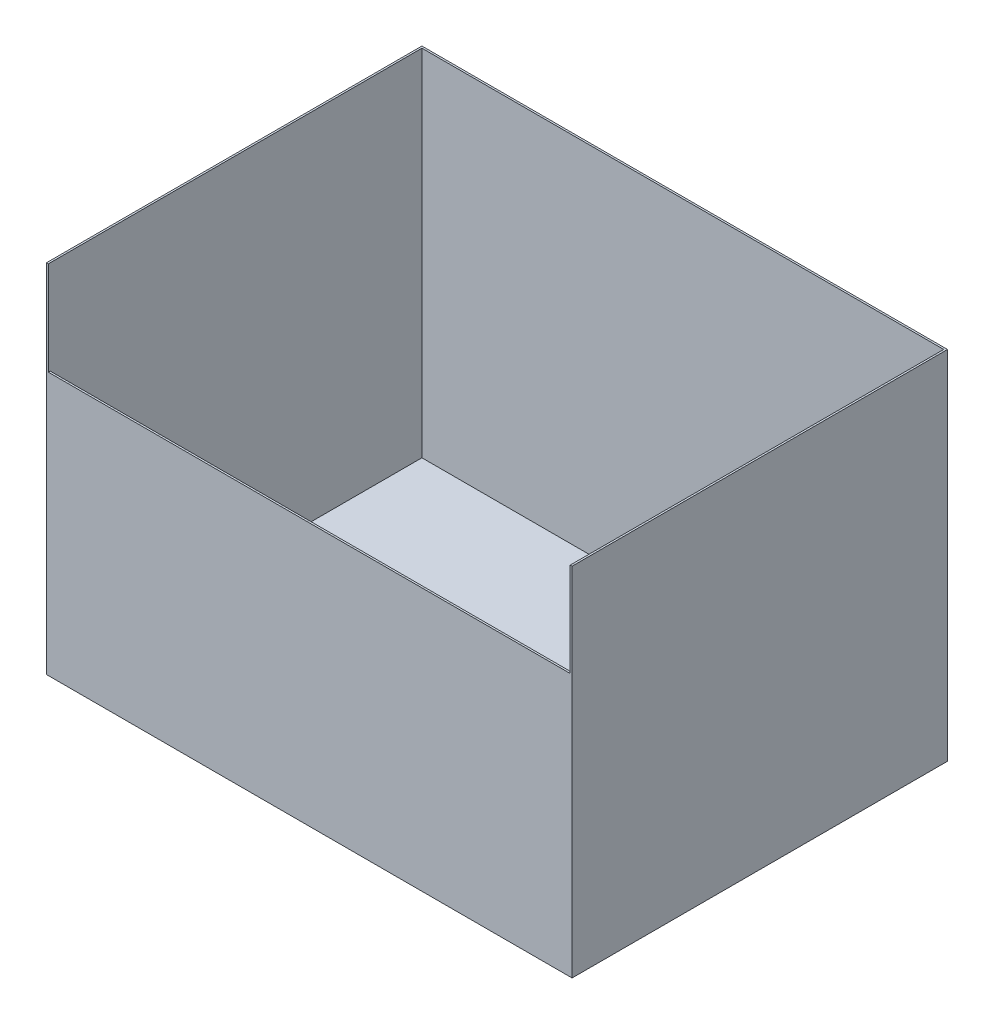
ISO-10303-21;
HEADER;
FILE_DESCRIPTION(('STEP AP214'),'2;1');
FILE_NAME('part.step','',(''),(''),'','','');
FILE_SCHEMA(('AUTOMOTIVE_DESIGN { 1 0 10303 214 1 1 1 1 }'));
ENDSEC;
DATA;
#1=APPLICATION_CONTEXT('core data for automotive mechanical design processes');
#2=APPLICATION_PROTOCOL_DEFINITION('international standard','automotive_design',2000,#1);
#3=PRODUCT_CONTEXT('',#1,'mechanical');
#4=PRODUCT('Part','Part','',(#3));
#5=PRODUCT_RELATED_PRODUCT_CATEGORY('part','',(#4));
#6=PRODUCT_DEFINITION_FORMATION('','',#4);
#7=PRODUCT_DEFINITION_CONTEXT('part definition',#1,'design');
#8=PRODUCT_DEFINITION('design','',#6,#7);
#9=PRODUCT_DEFINITION_SHAPE('','',#8);
#10=(LENGTH_UNIT() NAMED_UNIT(*) SI_UNIT(.MILLI.,.METRE.));
#11=(NAMED_UNIT(*) PLANE_ANGLE_UNIT() SI_UNIT($,.RADIAN.));
#12=(NAMED_UNIT(*) SI_UNIT($,.STERADIAN.) SOLID_ANGLE_UNIT());
#13=UNCERTAINTY_MEASURE_WITH_UNIT(LENGTH_MEASURE(1.E-05),#10,'distance_accuracy_value','');
#14=(GEOMETRIC_REPRESENTATION_CONTEXT(3) GLOBAL_UNCERTAINTY_ASSIGNED_CONTEXT((#13)) GLOBAL_UNIT_ASSIGNED_CONTEXT((#10,
#11,#12)) REPRESENTATION_CONTEXT('',''));
#15=CARTESIAN_POINT('',(0.,0.,0.));
#16=DIRECTION('',(0.,0.,1.));
#17=DIRECTION('',(1.,0.,0.));
#18=AXIS2_PLACEMENT_3D('',#15,#16,#17);
#19=CARTESIAN_POINT('',(-355.6,241.3,-254.));
#20=DIRECTION('',(1.,0.,0.));
#21=DIRECTION('',(0.,0.,-1.));
#22=AXIS2_PLACEMENT_3D('',#19,#20,#21);
#23=PLANE('',#22);
#24=DIRECTION('',(0.,0.,1.));
#25=VECTOR('',#24,1.);
#26=CARTESIAN_POINT('',(-355.6,-241.3,-254.));
#27=LINE('',#26,#25);
#28=CARTESIAN_POINT('',(-355.6,-241.3,-254.));
#29=VERTEX_POINT('',#28);
#30=CARTESIAN_POINT('',(-355.6,-241.3,254.));
#31=VERTEX_POINT('',#30);
#32=EDGE_CURVE('E145',#29,#31,#27,.T.);
#33=ORIENTED_EDGE('',*,*,#32,.T.);
#34=DIRECTION('',(0.,-1.,0.));
#35=VECTOR('',#34,1.);
#36=CARTESIAN_POINT('',(-355.6,241.3,254.));
#37=LINE('',#36,#35);
#38=CARTESIAN_POINT('',(-355.6,241.3,254.));
#39=VERTEX_POINT('',#38);
#40=EDGE_CURVE('E11',#39,#31,#37,.T.);
#41=ORIENTED_EDGE('',*,*,#40,.F.);
#42=DIRECTION('',(0.,0.,1.));
#43=VECTOR('',#42,1.);
#44=CARTESIAN_POINT('',(-355.6,241.3,-254.));
#45=LINE('',#44,#43);
#46=CARTESIAN_POINT('',(-355.6,241.3,-254.));
#47=VERTEX_POINT('',#46);
#48=EDGE_CURVE('E162',#47,#39,#45,.T.);
#49=ORIENTED_EDGE('',*,*,#48,.F.);
#50=DIRECTION('',(0.,-1.,0.));
#51=VECTOR('',#50,1.);
#52=CARTESIAN_POINT('',(-355.6,241.3,-254.));
#53=LINE('',#52,#51);
#54=EDGE_CURVE('E169',#47,#29,#53,.T.);
#55=ORIENTED_EDGE('',*,*,#54,.T.);
#56=EDGE_LOOP('',(#33,#41,#49,#55));
#57=FACE_BOUND('',#56,.T.);
#58=ADVANCED_FACE('F33',(#57),#23,.F.);
#59=CARTESIAN_POINT('',(-355.6,241.3,254.));
#60=DIRECTION('',(0.,0.,-1.));
#61=DIRECTION('',(-1.,0.,0.));
#62=AXIS2_PLACEMENT_3D('',#59,#60,#61);
#63=PLANE('',#62);
#64=DIRECTION('',(1.,0.,0.));
#65=VECTOR('',#64,1.);
#66=CARTESIAN_POINT('',(-353.06,114.3,254.));
#67=LINE('',#66,#65);
#68=CARTESIAN_POINT('',(-353.06,114.3,254.));
#69=VERTEX_POINT('',#68);
#70=CARTESIAN_POINT('',(353.06,114.3,254.));
#71=VERTEX_POINT('',#70);
#72=EDGE_CURVE('E125',#69,#71,#67,.T.);
#73=ORIENTED_EDGE('',*,*,#72,.F.);
#74=DIRECTION('',(0.,-1.,0.));
#75=VECTOR('',#74,1.);
#76=CARTESIAN_POINT('',(-353.06,241.3,254.));
#77=LINE('',#76,#75);
#78=CARTESIAN_POINT('',(-353.06,241.3,254.));
#79=VERTEX_POINT('',#78);
#80=EDGE_CURVE('E130',#79,#69,#77,.T.);
#81=ORIENTED_EDGE('',*,*,#80,.F.);
#82=DIRECTION('',(1.,0.,0.));
#83=VECTOR('',#82,1.);
#84=CARTESIAN_POINT('',(-355.6,241.3,254.));
#85=LINE('',#84,#83);
#86=EDGE_CURVE('E84',#39,#79,#85,.T.);
#87=ORIENTED_EDGE('',*,*,#86,.F.);
#88=ORIENTED_EDGE('',*,*,#40,.T.);
#89=DIRECTION('',(1.,0.,0.));
#90=VECTOR('',#89,1.);
#91=CARTESIAN_POINT('',(-355.6,-241.3,254.));
#92=LINE('',#91,#90);
#93=CARTESIAN_POINT('',(355.6,-241.3,254.));
#94=VERTEX_POINT('',#93);
#95=EDGE_CURVE('E172',#31,#94,#92,.T.);
#96=ORIENTED_EDGE('',*,*,#95,.T.);
#97=DIRECTION('',(0.,-1.,0.));
#98=VECTOR('',#97,1.);
#99=CARTESIAN_POINT('',(355.6,241.3,254.));
#100=LINE('',#99,#98);
#101=CARTESIAN_POINT('',(355.6,241.3,254.));
#102=VERTEX_POINT('',#101);
#103=EDGE_CURVE('E40',#102,#94,#100,.T.);
#104=ORIENTED_EDGE('',*,*,#103,.F.);
#105=CARTESIAN_POINT('',(353.06,241.3,254.));
#106=VERTEX_POINT('',#105);
#107=EDGE_CURVE('E164',#106,#102,#85,.T.);
#108=ORIENTED_EDGE('',*,*,#107,.F.);
#109=DIRECTION('',(0.,1.,0.));
#110=VECTOR('',#109,1.);
#111=CARTESIAN_POINT('',(353.06,241.3,254.));
#112=LINE('',#111,#110);
#113=EDGE_CURVE('E212',#71,#106,#112,.T.);
#114=ORIENTED_EDGE('',*,*,#113,.F.);
#115=EDGE_LOOP('',(#73,#81,#87,#88,#96,#104,#108,#114));
#116=FACE_BOUND('',#115,.T.);
#117=ADVANCED_FACE('F202',(#116),#63,.F.);
#118=CARTESIAN_POINT('',(355.6,241.3,-254.));
#119=DIRECTION('',(-1.,0.,0.));
#120=DIRECTION('',(0.,0.,1.));
#121=AXIS2_PLACEMENT_3D('',#118,#119,#120);
#122=PLANE('',#121);
#123=DIRECTION('',(0.,0.,-1.));
#124=VECTOR('',#123,1.);
#125=CARTESIAN_POINT('',(355.6,-241.3,-254.));
#126=LINE('',#125,#124);
#127=CARTESIAN_POINT('',(355.6,-241.3,-254.));
#128=VERTEX_POINT('',#127);
#129=EDGE_CURVE('E174',#94,#128,#126,.T.);
#130=ORIENTED_EDGE('',*,*,#129,.T.);
#131=DIRECTION('',(0.,-1.,0.));
#132=VECTOR('',#131,1.);
#133=CARTESIAN_POINT('',(355.6,241.3,-254.));
#134=LINE('',#133,#132);
#135=CARTESIAN_POINT('',(355.6,241.3,-254.));
#136=VERTEX_POINT('',#135);
#137=EDGE_CURVE('E178',#136,#128,#134,.T.);
#138=ORIENTED_EDGE('',*,*,#137,.F.);
#139=DIRECTION('',(0.,0.,-1.));
#140=VECTOR('',#139,1.);
#141=CARTESIAN_POINT('',(355.6,241.3,-254.));
#142=LINE('',#141,#140);
#143=EDGE_CURVE('E166',#102,#136,#142,.T.);
#144=ORIENTED_EDGE('',*,*,#143,.F.);
#145=ORIENTED_EDGE('',*,*,#103,.T.);
#146=EDGE_LOOP('',(#130,#138,#144,#145));
#147=FACE_BOUND('',#146,.T.);
#148=ADVANCED_FACE('F184',(#147),#122,.F.);
#149=CARTESIAN_POINT('',(-355.6,241.3,-254.));
#150=DIRECTION('',(0.,0.,1.));
#151=DIRECTION('',(1.,0.,0.));
#152=AXIS2_PLACEMENT_3D('',#149,#150,#151);
#153=PLANE('',#152);
#154=DIRECTION('',(-1.,0.,0.));
#155=VECTOR('',#154,1.);
#156=CARTESIAN_POINT('',(-355.6,-241.3,-254.));
#157=LINE('',#156,#155);
#158=EDGE_CURVE('E77',#128,#29,#157,.T.);
#159=ORIENTED_EDGE('',*,*,#158,.T.);
#160=ORIENTED_EDGE('',*,*,#54,.F.);
#161=DIRECTION('',(-1.,0.,0.));
#162=VECTOR('',#161,1.);
#163=CARTESIAN_POINT('',(-355.6,241.3,-254.));
#164=LINE('',#163,#162);
#165=EDGE_CURVE('E56',#136,#47,#164,.T.);
#166=ORIENTED_EDGE('',*,*,#165,.F.);
#167=ORIENTED_EDGE('',*,*,#137,.T.);
#168=EDGE_LOOP('',(#159,#160,#166,#167));
#169=FACE_BOUND('',#168,.T.);
#170=ADVANCED_FACE('F193',(#169),#153,.F.);
#171=CARTESIAN_POINT('',(0.,241.3,0.));
#172=DIRECTION('',(0.,1.,0.));
#173=DIRECTION('',(0.,0.,1.));
#174=AXIS2_PLACEMENT_3D('',#171,#172,#173);
#175=PLANE('',#174);
#176=ORIENTED_EDGE('',*,*,#86,.T.);
#177=DIRECTION('',(0.,0.,1.));
#178=VECTOR('',#177,1.);
#179=CARTESIAN_POINT('',(-353.06,241.3,-254.));
#180=LINE('',#179,#178);
#181=CARTESIAN_POINT('',(-353.06,241.3,-251.46));
#182=VERTEX_POINT('',#181);
#183=EDGE_CURVE('E156',#182,#79,#180,.T.);
#184=ORIENTED_EDGE('',*,*,#183,.F.);
#185=DIRECTION('',(-1.,0.,0.));
#186=VECTOR('',#185,1.);
#187=CARTESIAN_POINT('',(-355.6,241.3,-251.46));
#188=LINE('',#187,#186);
#189=CARTESIAN_POINT('',(353.06,241.3,-251.46));
#190=VERTEX_POINT('',#189);
#191=EDGE_CURVE('E160',#190,#182,#188,.T.);
#192=ORIENTED_EDGE('',*,*,#191,.F.);
#193=DIRECTION('',(0.,0.,-1.));
#194=VECTOR('',#193,1.);
#195=CARTESIAN_POINT('',(353.06,241.3,-254.));
#196=LINE('',#195,#194);
#197=EDGE_CURVE('E158',#106,#190,#196,.T.);
#198=ORIENTED_EDGE('',*,*,#197,.F.);
#199=ORIENTED_EDGE('',*,*,#107,.T.);
#200=ORIENTED_EDGE('',*,*,#143,.T.);
#201=ORIENTED_EDGE('',*,*,#165,.T.);
#202=ORIENTED_EDGE('',*,*,#48,.T.);
#203=EDGE_LOOP('',(#176,#184,#192,#198,#199,#200,#201,#202));
#204=FACE_BOUND('',#203,.T.);
#205=ADVANCED_FACE('F195',(#204),#175,.T.);
#206=CARTESIAN_POINT('',(0.,-241.3,0.));
#207=DIRECTION('',(0.,1.,0.));
#208=DIRECTION('',(0.,0.,1.));
#209=AXIS2_PLACEMENT_3D('',#206,#207,#208);
#210=PLANE('',#209);
#211=ORIENTED_EDGE('',*,*,#32,.F.);
#212=ORIENTED_EDGE('',*,*,#158,.F.);
#213=ORIENTED_EDGE('',*,*,#129,.F.);
#214=ORIENTED_EDGE('',*,*,#95,.F.);
#215=EDGE_LOOP('',(#211,#212,#213,#214));
#216=FACE_BOUND('',#215,.T.);
#217=ADVANCED_FACE('F189',(#216),#210,.F.);
#218=CARTESIAN_POINT('',(-353.06,241.3,-254.));
#219=DIRECTION('',(1.,0.,0.));
#220=DIRECTION('',(0.,0.,-1.));
#221=AXIS2_PLACEMENT_3D('',#218,#219,#220);
#222=PLANE('',#221);
#223=DIRECTION('',(0.,0.,1.));
#224=VECTOR('',#223,1.);
#225=CARTESIAN_POINT('',(-353.06,-238.76,-254.));
#226=LINE('',#225,#224);
#227=CARTESIAN_POINT('',(-353.06,-238.76,-251.46));
#228=VERTEX_POINT('',#227);
#229=CARTESIAN_POINT('',(-353.06,-238.76,251.46));
#230=VERTEX_POINT('',#229);
#231=EDGE_CURVE('E214',#228,#230,#226,.T.);
#232=ORIENTED_EDGE('',*,*,#231,.F.);
#233=DIRECTION('',(0.,-1.,0.));
#234=VECTOR('',#233,1.);
#235=CARTESIAN_POINT('',(-353.06,241.3,-251.46));
#236=LINE('',#235,#234);
#237=EDGE_CURVE('E147',#182,#228,#236,.T.);
#238=ORIENTED_EDGE('',*,*,#237,.F.);
#239=ORIENTED_EDGE('',*,*,#183,.T.);
#240=ORIENTED_EDGE('',*,*,#80,.T.);
#241=DIRECTION('',(0.,0.,1.));
#242=VECTOR('',#241,1.);
#243=CARTESIAN_POINT('',(-353.06,114.3,-254.001));
#244=LINE('',#243,#242);
#245=CARTESIAN_POINT('',(-353.06,114.3,251.46));
#246=VERTEX_POINT('',#245);
#247=EDGE_CURVE('E139',#246,#69,#244,.T.);
#248=ORIENTED_EDGE('',*,*,#247,.F.);
#249=DIRECTION('',(0.,-1.,0.));
#250=VECTOR('',#249,1.);
#251=CARTESIAN_POINT('',(-353.06,241.3,251.46));
#252=LINE('',#251,#250);
#253=EDGE_CURVE('E138',#246,#230,#252,.T.);
#254=ORIENTED_EDGE('',*,*,#253,.T.);
#255=EDGE_LOOP('',(#232,#238,#239,#240,#248,#254));
#256=FACE_BOUND('',#255,.T.);
#257=ADVANCED_FACE('F227',(#256),#222,.T.);
#258=CARTESIAN_POINT('',(-355.6,241.3,251.46));
#259=DIRECTION('',(0.,0.,-1.));
#260=DIRECTION('',(-1.,0.,0.));
#261=AXIS2_PLACEMENT_3D('',#258,#259,#260);
#262=PLANE('',#261);
#263=DIRECTION('',(1.,0.,0.));
#264=VECTOR('',#263,1.);
#265=CARTESIAN_POINT('',(-353.06,114.3,251.46));
#266=LINE('',#265,#264);
#267=CARTESIAN_POINT('',(353.06,114.3,251.46));
#268=VERTEX_POINT('',#267);
#269=EDGE_CURVE('E122',#246,#268,#266,.T.);
#270=ORIENTED_EDGE('',*,*,#269,.T.);
#271=DIRECTION('',(0.,-1.,0.));
#272=VECTOR('',#271,1.);
#273=CARTESIAN_POINT('',(353.06,241.3,251.46));
#274=LINE('',#273,#272);
#275=CARTESIAN_POINT('',(353.06,-238.76,251.46));
#276=VERTEX_POINT('',#275);
#277=EDGE_CURVE('E136',#268,#276,#274,.T.);
#278=ORIENTED_EDGE('',*,*,#277,.T.);
#279=DIRECTION('',(1.,0.,0.));
#280=VECTOR('',#279,1.);
#281=CARTESIAN_POINT('',(-355.6,-238.76,251.46));
#282=LINE('',#281,#280);
#283=EDGE_CURVE('E151',#230,#276,#282,.T.);
#284=ORIENTED_EDGE('',*,*,#283,.F.);
#285=ORIENTED_EDGE('',*,*,#253,.F.);
#286=EDGE_LOOP('',(#270,#278,#284,#285));
#287=FACE_BOUND('',#286,.T.);
#288=ADVANCED_FACE('F134',(#287),#262,.T.);
#289=CARTESIAN_POINT('',(353.06,241.3,-254.));
#290=DIRECTION('',(-1.,0.,0.));
#291=DIRECTION('',(0.,0.,1.));
#292=AXIS2_PLACEMENT_3D('',#289,#290,#291);
#293=PLANE('',#292);
#294=DIRECTION('',(0.,0.,-1.));
#295=VECTOR('',#294,1.);
#296=CARTESIAN_POINT('',(353.06,-238.76,-254.));
#297=LINE('',#296,#295);
#298=CARTESIAN_POINT('',(353.06,-238.76,-251.46));
#299=VERTEX_POINT('',#298);
#300=EDGE_CURVE('E143',#276,#299,#297,.T.);
#301=ORIENTED_EDGE('',*,*,#300,.F.);
#302=ORIENTED_EDGE('',*,*,#277,.F.);
#303=DIRECTION('',(0.,0.,1.));
#304=VECTOR('',#303,1.);
#305=CARTESIAN_POINT('',(353.06,114.3,-254.001));
#306=LINE('',#305,#304);
#307=EDGE_CURVE('E119',#268,#71,#306,.T.);
#308=ORIENTED_EDGE('',*,*,#307,.T.);
#309=ORIENTED_EDGE('',*,*,#113,.T.);
#310=ORIENTED_EDGE('',*,*,#197,.T.);
#311=DIRECTION('',(0.,-1.,0.));
#312=VECTOR('',#311,1.);
#313=CARTESIAN_POINT('',(353.06,241.3,-251.46));
#314=LINE('',#313,#312);
#315=EDGE_CURVE('E47',#190,#299,#314,.T.);
#316=ORIENTED_EDGE('',*,*,#315,.T.);
#317=EDGE_LOOP('',(#301,#302,#308,#309,#310,#316));
#318=FACE_BOUND('',#317,.T.);
#319=ADVANCED_FACE('F142',(#318),#293,.T.);
#320=CARTESIAN_POINT('',(-355.6,241.3,-251.46));
#321=DIRECTION('',(0.,0.,1.));
#322=DIRECTION('',(1.,0.,0.));
#323=AXIS2_PLACEMENT_3D('',#320,#321,#322);
#324=PLANE('',#323);
#325=DIRECTION('',(-1.,0.,0.));
#326=VECTOR('',#325,1.);
#327=CARTESIAN_POINT('',(-355.6,-238.76,-251.46));
#328=LINE('',#327,#326);
#329=EDGE_CURVE('E153',#299,#228,#328,.T.);
#330=ORIENTED_EDGE('',*,*,#329,.F.);
#331=ORIENTED_EDGE('',*,*,#315,.F.);
#332=ORIENTED_EDGE('',*,*,#191,.T.);
#333=ORIENTED_EDGE('',*,*,#237,.T.);
#334=EDGE_LOOP('',(#330,#331,#332,#333));
#335=FACE_BOUND('',#334,.T.);
#336=ADVANCED_FACE('F223',(#335),#324,.T.);
#337=CARTESIAN_POINT('',(0.,-238.76,0.));
#338=DIRECTION('',(0.,1.,0.));
#339=DIRECTION('',(0.,0.,1.));
#340=AXIS2_PLACEMENT_3D('',#337,#338,#339);
#341=PLANE('',#340);
#342=ORIENTED_EDGE('',*,*,#231,.T.);
#343=ORIENTED_EDGE('',*,*,#283,.T.);
#344=ORIENTED_EDGE('',*,*,#300,.T.);
#345=ORIENTED_EDGE('',*,*,#329,.T.);
#346=EDGE_LOOP('',(#342,#343,#344,#345));
#347=FACE_BOUND('',#346,.T.);
#348=ADVANCED_FACE('F229',(#347),#341,.T.);
#349=CARTESIAN_POINT('',(-353.06,114.3,-254.001));
#350=DIRECTION('',(0.,-1.,0.));
#351=DIRECTION('',(0.,0.,-1.));
#352=AXIS2_PLACEMENT_3D('',#349,#350,#351);
#353=PLANE('',#352);
#354=ORIENTED_EDGE('',*,*,#247,.T.);
#355=ORIENTED_EDGE('',*,*,#72,.T.);
#356=ORIENTED_EDGE('',*,*,#307,.F.);
#357=ORIENTED_EDGE('',*,*,#269,.F.);
#358=EDGE_LOOP('',(#354,#355,#356,#357));
#359=FACE_BOUND('',#358,.T.);
#360=ADVANCED_FACE('F121',(#359),#353,.F.);
#361=CLOSED_SHELL('',(#58,#117,#148,#170,#205,#217,#257,#288,#319,#336,#348,#360));
#362=MANIFOLD_SOLID_BREP('B2',#361);
#363=ADVANCED_BREP_SHAPE_REPRESENTATION('',(#18,#362),#14);
#364=SHAPE_DEFINITION_REPRESENTATION(#9,#363);
ENDSEC;
END-ISO-10303-21;
